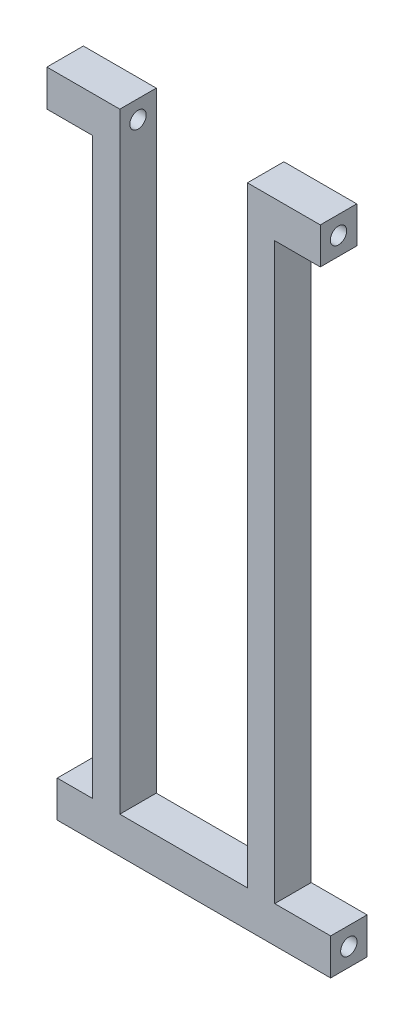
ISO-10303-21;
HEADER;
FILE_DESCRIPTION(('STEP AP214'),'2;1');
FILE_NAME('part.step','',(''),(''),'','','');
FILE_SCHEMA(('AUTOMOTIVE_DESIGN { 1 0 10303 214 1 1 1 1 }'));
ENDSEC;
DATA;
#1=APPLICATION_CONTEXT('core data for automotive mechanical design processes');
#2=APPLICATION_PROTOCOL_DEFINITION('international standard','automotive_design',2000,#1);
#3=PRODUCT_CONTEXT('',#1,'mechanical');
#4=PRODUCT('Part','Part','',(#3));
#5=PRODUCT_RELATED_PRODUCT_CATEGORY('part','',(#4));
#6=PRODUCT_DEFINITION_FORMATION('','',#4);
#7=PRODUCT_DEFINITION_CONTEXT('part definition',#1,'design');
#8=PRODUCT_DEFINITION('design','',#6,#7);
#9=PRODUCT_DEFINITION_SHAPE('','',#8);
#10=(LENGTH_UNIT() NAMED_UNIT(*) SI_UNIT(.MILLI.,.METRE.));
#11=(NAMED_UNIT(*) PLANE_ANGLE_UNIT() SI_UNIT($,.RADIAN.));
#12=(NAMED_UNIT(*) SI_UNIT($,.STERADIAN.) SOLID_ANGLE_UNIT());
#13=UNCERTAINTY_MEASURE_WITH_UNIT(LENGTH_MEASURE(1.E-05),#10,'distance_accuracy_value','');
#14=(GEOMETRIC_REPRESENTATION_CONTEXT(3) GLOBAL_UNCERTAINTY_ASSIGNED_CONTEXT((#13)) GLOBAL_UNIT_ASSIGNED_CONTEXT((#10,
#11,#12)) REPRESENTATION_CONTEXT('',''));
#15=CARTESIAN_POINT('',(0.,0.,0.));
#16=DIRECTION('',(0.,0.,1.));
#17=DIRECTION('',(1.,0.,0.));
#18=AXIS2_PLACEMENT_3D('',#15,#16,#17);
#19=CARTESIAN_POINT('',(-2.26904501258947,0.,8.));
#20=DIRECTION('',(1.,0.,0.));
#21=DIRECTION('',(0.,1.,0.));
#22=AXIS2_PLACEMENT_3D('',#19,#20,#21);
#23=PLANE('',#22);
#24=CARTESIAN_POINT('',(-2.2690450125895,138.,4.));
#25=DIRECTION('',(1.,0.,0.));
#26=DIRECTION('',(0.,0.,-1.));
#27=AXIS2_PLACEMENT_3D('',#24,#25,#26);
#28=CIRCLE('',#27,1.8);
#29=CARTESIAN_POINT('',(-2.2690450125895,138.,2.2));
#30=VERTEX_POINT('',#29);
#31=EDGE_CURVE('E206',#30,#30,#28,.T.);
#32=ORIENTED_EDGE('',*,*,#31,.T.);
#33=EDGE_LOOP('',(#32));
#34=FACE_BOUND('',#33,.T.);
#35=DIRECTION('',(0.,-1.,0.));
#36=VECTOR('',#35,1.);
#37=CARTESIAN_POINT('',(-2.26904501258947,0.,0.));
#38=LINE('',#37,#36);
#39=CARTESIAN_POINT('',(-2.26904501258951,142.,0.));
#40=VERTEX_POINT('',#39);
#41=CARTESIAN_POINT('',(-2.2690450125895,134.,0.));
#42=VERTEX_POINT('',#41);
#43=EDGE_CURVE('E202',#40,#42,#38,.T.);
#44=ORIENTED_EDGE('',*,*,#43,.T.);
#45=DIRECTION('',(0.,0.,-1.));
#46=VECTOR('',#45,1.);
#47=CARTESIAN_POINT('',(-2.2690450125895,134.,8.));
#48=LINE('',#47,#46);
#49=CARTESIAN_POINT('',(-2.2690450125895,134.,8.));
#50=VERTEX_POINT('',#49);
#51=EDGE_CURVE('E11',#50,#42,#48,.T.);
#52=ORIENTED_EDGE('',*,*,#51,.F.);
#53=DIRECTION('',(0.,-1.,0.));
#54=VECTOR('',#53,1.);
#55=CARTESIAN_POINT('',(-2.26904501258947,0.,8.));
#56=LINE('',#55,#54);
#57=CARTESIAN_POINT('',(-2.26904501258951,142.,8.));
#58=VERTEX_POINT('',#57);
#59=EDGE_CURVE('E194',#58,#50,#56,.T.);
#60=ORIENTED_EDGE('',*,*,#59,.F.);
#61=DIRECTION('',(0.,0.,-1.));
#62=VECTOR('',#61,1.);
#63=CARTESIAN_POINT('',(-2.26904501258951,142.,8.));
#64=LINE('',#63,#62);
#65=EDGE_CURVE('E49',#58,#40,#64,.T.);
#66=ORIENTED_EDGE('',*,*,#65,.T.);
#67=EDGE_LOOP('',(#44,#52,#60,#66));
#68=FACE_BOUND('',#67,.T.);
#69=ADVANCED_FACE('F33',(#34,#68),#23,.F.);
#70=CARTESIAN_POINT('',(0.,134.,8.));
#71=DIRECTION('',(0.,1.,0.));
#72=DIRECTION('',(0.,0.,1.));
#73=AXIS2_PLACEMENT_3D('',#70,#71,#72);
#74=PLANE('',#73);
#75=DIRECTION('',(1.,0.,0.));
#76=VECTOR('',#75,1.);
#77=CARTESIAN_POINT('',(0.,134.,0.));
#78=LINE('',#77,#76);
#79=CARTESIAN_POINT('',(7.7309549874105,134.,0.));
#80=VERTEX_POINT('',#79);
#81=EDGE_CURVE('E296',#42,#80,#78,.T.);
#82=ORIENTED_EDGE('',*,*,#81,.T.);
#83=DIRECTION('',(0.,0.,-1.));
#84=VECTOR('',#83,1.);
#85=CARTESIAN_POINT('',(7.7309549874105,134.,8.));
#86=LINE('',#85,#84);
#87=CARTESIAN_POINT('',(7.7309549874105,134.,8.));
#88=VERTEX_POINT('',#87);
#89=EDGE_CURVE('E41',#88,#80,#86,.T.);
#90=ORIENTED_EDGE('',*,*,#89,.F.);
#91=DIRECTION('',(1.,0.,0.));
#92=VECTOR('',#91,1.);
#93=CARTESIAN_POINT('',(0.,134.,8.));
#94=LINE('',#93,#92);
#95=EDGE_CURVE('E112',#50,#88,#94,.T.);
#96=ORIENTED_EDGE('',*,*,#95,.F.);
#97=ORIENTED_EDGE('',*,*,#51,.T.);
#98=EDGE_LOOP('',(#82,#90,#96,#97));
#99=FACE_BOUND('',#98,.T.);
#100=ADVANCED_FACE('F297',(#99),#74,.F.);
#101=CARTESIAN_POINT('',(7.7309549874105,0.,8.));
#102=DIRECTION('',(-1.,0.,0.));
#103=DIRECTION('',(0.,-1.,0.));
#104=AXIS2_PLACEMENT_3D('',#101,#102,#103);
#105=PLANE('',#104);
#106=DIRECTION('',(0.,1.,0.));
#107=VECTOR('',#106,1.);
#108=CARTESIAN_POINT('',(7.7309549874105,0.,0.));
#109=LINE('',#108,#107);
#110=CARTESIAN_POINT('',(7.7309549874105,8.,0.));
#111=VERTEX_POINT('',#110);
#112=EDGE_CURVE('E256',#111,#80,#109,.T.);
#113=ORIENTED_EDGE('',*,*,#112,.F.);
#114=DIRECTION('',(0.,0.,-1.));
#115=VECTOR('',#114,1.);
#116=CARTESIAN_POINT('',(7.7309549874105,8.,8.));
#117=LINE('',#116,#115);
#118=CARTESIAN_POINT('',(7.7309549874105,8.,8.));
#119=VERTEX_POINT('',#118);
#120=EDGE_CURVE('E291',#119,#111,#117,.T.);
#121=ORIENTED_EDGE('',*,*,#120,.F.);
#122=DIRECTION('',(0.,1.,0.));
#123=VECTOR('',#122,1.);
#124=CARTESIAN_POINT('',(7.7309549874105,0.,8.));
#125=LINE('',#124,#123);
#126=EDGE_CURVE('E186',#119,#88,#125,.T.);
#127=ORIENTED_EDGE('',*,*,#126,.T.);
#128=ORIENTED_EDGE('',*,*,#89,.T.);
#129=EDGE_LOOP('',(#113,#121,#127,#128));
#130=FACE_BOUND('',#129,.T.);
#131=ADVANCED_FACE('F294',(#130),#105,.T.);
#132=CARTESIAN_POINT('',(0.,8.,8.));
#133=DIRECTION('',(0.,1.,0.));
#134=DIRECTION('',(0.,0.,1.));
#135=AXIS2_PLACEMENT_3D('',#132,#133,#134);
#136=PLANE('',#135);
#137=DIRECTION('',(1.,0.,0.));
#138=VECTOR('',#137,1.);
#139=CARTESIAN_POINT('',(0.,8.,0.));
#140=LINE('',#139,#138);
#141=CARTESIAN_POINT('',(0.,8.,0.));
#142=VERTEX_POINT('',#141);
#143=EDGE_CURVE('E249',#142,#111,#140,.T.);
#144=ORIENTED_EDGE('',*,*,#143,.F.);
#145=DIRECTION('',(0.,0.,-1.));
#146=VECTOR('',#145,1.);
#147=CARTESIAN_POINT('',(0.,8.,8.));
#148=LINE('',#147,#146);
#149=CARTESIAN_POINT('',(0.,8.,8.));
#150=VERTEX_POINT('',#149);
#151=EDGE_CURVE('E289',#150,#142,#148,.T.);
#152=ORIENTED_EDGE('',*,*,#151,.F.);
#153=DIRECTION('',(1.,0.,0.));
#154=VECTOR('',#153,1.);
#155=CARTESIAN_POINT('',(0.,8.,8.));
#156=LINE('',#155,#154);
#157=EDGE_CURVE('E176',#150,#119,#156,.T.);
#158=ORIENTED_EDGE('',*,*,#157,.T.);
#159=ORIENTED_EDGE('',*,*,#120,.T.);
#160=EDGE_LOOP('',(#144,#152,#158,#159));
#161=FACE_BOUND('',#160,.T.);
#162=ADVANCED_FACE('F348',(#161),#136,.T.);
#163=CARTESIAN_POINT('',(0.,0.,8.));
#164=DIRECTION('',(-1.,0.,0.));
#165=DIRECTION('',(0.,0.,1.));
#166=AXIS2_PLACEMENT_3D('',#163,#164,#165);
#167=PLANE('',#166);
#168=CARTESIAN_POINT('',(0.,4.,4.));
#169=DIRECTION('',(-1.,0.,0.));
#170=DIRECTION('',(0.,0.,1.));
#171=AXIS2_PLACEMENT_3D('',#168,#169,#170);
#172=CIRCLE('',#171,1.79999999999999);
#173=CARTESIAN_POINT('',(0.,4.,5.79999999999999));
#174=VERTEX_POINT('',#173);
#175=EDGE_CURVE('E212',#174,#174,#172,.T.);
#176=ORIENTED_EDGE('',*,*,#175,.F.);
#177=EDGE_LOOP('',(#176));
#178=FACE_BOUND('',#177,.T.);
#179=DIRECTION('',(0.,1.,0.));
#180=VECTOR('',#179,1.);
#181=CARTESIAN_POINT('',(0.,0.,0.));
#182=LINE('',#181,#180);
#183=CARTESIAN_POINT('',(0.,0.,0.));
#184=VERTEX_POINT('',#183);
#185=EDGE_CURVE('E255',#184,#142,#182,.T.);
#186=ORIENTED_EDGE('',*,*,#185,.F.);
#187=DIRECTION('',(0.,0.,-1.));
#188=VECTOR('',#187,1.);
#189=CARTESIAN_POINT('',(0.,0.,8.));
#190=LINE('',#189,#188);
#191=CARTESIAN_POINT('',(0.,0.,8.));
#192=VERTEX_POINT('',#191);
#193=EDGE_CURVE('E287',#192,#184,#190,.T.);
#194=ORIENTED_EDGE('',*,*,#193,.F.);
#195=DIRECTION('',(0.,1.,0.));
#196=VECTOR('',#195,1.);
#197=CARTESIAN_POINT('',(0.,0.,8.));
#198=LINE('',#197,#196);
#199=EDGE_CURVE('E185',#192,#150,#198,.T.);
#200=ORIENTED_EDGE('',*,*,#199,.T.);
#201=ORIENTED_EDGE('',*,*,#151,.T.);
#202=EDGE_LOOP('',(#186,#194,#200,#201));
#203=FACE_BOUND('',#202,.T.);
#204=ADVANCED_FACE('F381',(#178,#203),#167,.T.);
#205=CARTESIAN_POINT('',(0.,0.,8.));
#206=DIRECTION('',(0.,1.,0.));
#207=DIRECTION('',(0.,0.,1.));
#208=AXIS2_PLACEMENT_3D('',#205,#206,#207);
#209=PLANE('',#208);
#210=DIRECTION('',(1.,0.,0.));
#211=VECTOR('',#210,1.);
#212=CARTESIAN_POINT('',(0.,0.,0.));
#213=LINE('',#212,#211);
#214=CARTESIAN_POINT('',(60.,0.,0.));
#215=VERTEX_POINT('',#214);
#216=EDGE_CURVE('E240',#184,#215,#213,.T.);
#217=ORIENTED_EDGE('',*,*,#216,.T.);
#218=DIRECTION('',(0.,0.,-1.));
#219=VECTOR('',#218,1.);
#220=CARTESIAN_POINT('',(60.,0.,8.));
#221=LINE('',#220,#219);
#222=CARTESIAN_POINT('',(60.,0.,8.));
#223=VERTEX_POINT('',#222);
#224=EDGE_CURVE('E236',#223,#215,#221,.T.);
#225=ORIENTED_EDGE('',*,*,#224,.F.);
#226=DIRECTION('',(1.,0.,0.));
#227=VECTOR('',#226,1.);
#228=CARTESIAN_POINT('',(0.,0.,8.));
#229=LINE('',#228,#227);
#230=EDGE_CURVE('E190',#192,#223,#229,.T.);
#231=ORIENTED_EDGE('',*,*,#230,.F.);
#232=ORIENTED_EDGE('',*,*,#193,.T.);
#233=EDGE_LOOP('',(#217,#225,#231,#232));
#234=FACE_BOUND('',#233,.T.);
#235=ADVANCED_FACE('F225',(#234),#209,.F.);
#236=CARTESIAN_POINT('',(60.,0.,8.));
#237=DIRECTION('',(-1.,0.,0.));
#238=DIRECTION('',(0.,0.,1.));
#239=AXIS2_PLACEMENT_3D('',#236,#237,#238);
#240=PLANE('',#239);
#241=CARTESIAN_POINT('',(60.,4.,4.));
#242=DIRECTION('',(1.,0.,0.));
#243=DIRECTION('',(0.,0.,-1.));
#244=AXIS2_PLACEMENT_3D('',#241,#242,#243);
#245=CIRCLE('',#244,1.79999999999999);
#246=CARTESIAN_POINT('',(60.,4.,2.20000000000001));
#247=VERTEX_POINT('',#246);
#248=EDGE_CURVE('E215',#247,#247,#245,.T.);
#249=ORIENTED_EDGE('',*,*,#248,.F.);
#250=EDGE_LOOP('',(#249));
#251=FACE_BOUND('',#250,.T.);
#252=DIRECTION('',(0.,1.,0.));
#253=VECTOR('',#252,1.);
#254=CARTESIAN_POINT('',(60.,0.,0.));
#255=LINE('',#254,#253);
#256=CARTESIAN_POINT('',(60.,8.,0.));
#257=VERTEX_POINT('',#256);
#258=EDGE_CURVE('E231',#215,#257,#255,.T.);
#259=ORIENTED_EDGE('',*,*,#258,.T.);
#260=DIRECTION('',(0.,0.,-1.));
#261=VECTOR('',#260,1.);
#262=CARTESIAN_POINT('',(60.,8.,8.));
#263=LINE('',#262,#261);
#264=CARTESIAN_POINT('',(60.,8.,8.));
#265=VERTEX_POINT('',#264);
#266=EDGE_CURVE('E234',#265,#257,#263,.T.);
#267=ORIENTED_EDGE('',*,*,#266,.F.);
#268=DIRECTION('',(0.,1.,0.));
#269=VECTOR('',#268,1.);
#270=CARTESIAN_POINT('',(60.,0.,8.));
#271=LINE('',#270,#269);
#272=EDGE_CURVE('E183',#223,#265,#271,.T.);
#273=ORIENTED_EDGE('',*,*,#272,.F.);
#274=ORIENTED_EDGE('',*,*,#224,.T.);
#275=EDGE_LOOP('',(#259,#267,#273,#274));
#276=FACE_BOUND('',#275,.T.);
#277=ADVANCED_FACE('F221',(#251,#276),#240,.F.);
#278=CARTESIAN_POINT('',(47.7309549874105,8.,0.));
#279=VERTEX_POINT('',#278);
#280=EDGE_CURVE('E239',#279,#257,#140,.T.);
#281=ORIENTED_EDGE('',*,*,#280,.F.);
#282=DIRECTION('',(0.,0.,-1.));
#283=VECTOR('',#282,1.);
#284=CARTESIAN_POINT('',(47.7309549874105,8.,8.));
#285=LINE('',#284,#283);
#286=CARTESIAN_POINT('',(47.7309549874105,8.,8.));
#287=VERTEX_POINT('',#286);
#288=EDGE_CURVE('E283',#287,#279,#285,.T.);
#289=ORIENTED_EDGE('',*,*,#288,.F.);
#290=EDGE_CURVE('E175',#287,#265,#156,.T.);
#291=ORIENTED_EDGE('',*,*,#290,.T.);
#292=ORIENTED_EDGE('',*,*,#266,.T.);
#293=EDGE_LOOP('',(#281,#289,#291,#292));
#294=FACE_BOUND('',#293,.T.);
#295=ADVANCED_FACE('F224',(#294),#136,.T.);
#296=CARTESIAN_POINT('',(47.7309549874105,0.,8.));
#297=DIRECTION('',(-1.,0.,0.));
#298=DIRECTION('',(0.,0.,1.));
#299=AXIS2_PLACEMENT_3D('',#296,#297,#298);
#300=PLANE('',#299);
#301=DIRECTION('',(0.,1.,0.));
#302=VECTOR('',#301,1.);
#303=CARTESIAN_POINT('',(47.7309549874105,0.,0.));
#304=LINE('',#303,#302);
#305=CARTESIAN_POINT('',(47.7309549874105,134.,0.));
#306=VERTEX_POINT('',#305);
#307=EDGE_CURVE('E246',#279,#306,#304,.T.);
#308=ORIENTED_EDGE('',*,*,#307,.T.);
#309=DIRECTION('',(0.,0.,-1.));
#310=VECTOR('',#309,1.);
#311=CARTESIAN_POINT('',(47.7309549874105,134.,8.));
#312=LINE('',#311,#310);
#313=CARTESIAN_POINT('',(47.7309549874105,134.,8.));
#314=VERTEX_POINT('',#313);
#315=EDGE_CURVE('E280',#314,#306,#312,.T.);
#316=ORIENTED_EDGE('',*,*,#315,.F.);
#317=DIRECTION('',(0.,1.,0.));
#318=VECTOR('',#317,1.);
#319=CARTESIAN_POINT('',(47.7309549874105,0.,8.));
#320=LINE('',#319,#318);
#321=EDGE_CURVE('E182',#287,#314,#320,.T.);
#322=ORIENTED_EDGE('',*,*,#321,.F.);
#323=ORIENTED_EDGE('',*,*,#288,.T.);
#324=EDGE_LOOP('',(#308,#316,#322,#323));
#325=FACE_BOUND('',#324,.T.);
#326=ADVANCED_FACE('F335',(#325),#300,.F.);
#327=CARTESIAN_POINT('',(0.,134.,8.));
#328=DIRECTION('',(0.,1.,0.));
#329=DIRECTION('',(0.,0.,1.));
#330=AXIS2_PLACEMENT_3D('',#327,#328,#329);
#331=PLANE('',#330);
#332=DIRECTION('',(1.,0.,0.));
#333=VECTOR('',#332,1.);
#334=CARTESIAN_POINT('',(0.,134.,0.));
#335=LINE('',#334,#333);
#336=CARTESIAN_POINT('',(57.7309549874105,134.,0.));
#337=VERTEX_POINT('',#336);
#338=EDGE_CURVE('E250',#306,#337,#335,.T.);
#339=ORIENTED_EDGE('',*,*,#338,.T.);
#340=DIRECTION('',(0.,0.,-1.));
#341=VECTOR('',#340,1.);
#342=CARTESIAN_POINT('',(57.7309549874105,134.,8.));
#343=LINE('',#342,#341);
#344=CARTESIAN_POINT('',(57.7309549874105,134.,8.));
#345=VERTEX_POINT('',#344);
#346=EDGE_CURVE('E278',#345,#337,#343,.T.);
#347=ORIENTED_EDGE('',*,*,#346,.F.);
#348=DIRECTION('',(1.,0.,0.));
#349=VECTOR('',#348,1.);
#350=CARTESIAN_POINT('',(0.,134.,8.));
#351=LINE('',#350,#349);
#352=EDGE_CURVE('E310',#314,#345,#351,.T.);
#353=ORIENTED_EDGE('',*,*,#352,.F.);
#354=ORIENTED_EDGE('',*,*,#315,.T.);
#355=EDGE_LOOP('',(#339,#347,#353,#354));
#356=FACE_BOUND('',#355,.T.);
#357=ADVANCED_FACE('F331',(#356),#331,.F.);
#358=CARTESIAN_POINT('',(57.7309549874104,0.,8.));
#359=DIRECTION('',(1.,0.,0.));
#360=DIRECTION('',(0.,1.,0.));
#361=AXIS2_PLACEMENT_3D('',#358,#359,#360);
#362=PLANE('',#361);
#363=CARTESIAN_POINT('',(57.7309549874105,138.,4.));
#364=DIRECTION('',(1.,0.,0.));
#365=DIRECTION('',(0.,0.,-1.));
#366=AXIS2_PLACEMENT_3D('',#363,#364,#365);
#367=CIRCLE('',#366,1.8);
#368=CARTESIAN_POINT('',(57.7309549874105,138.,2.2));
#369=VERTEX_POINT('',#368);
#370=EDGE_CURVE('E209',#369,#369,#367,.T.);
#371=ORIENTED_EDGE('',*,*,#370,.F.);
#372=EDGE_LOOP('',(#371));
#373=FACE_BOUND('',#372,.T.);
#374=DIRECTION('',(0.,-1.,0.));
#375=VECTOR('',#374,1.);
#376=CARTESIAN_POINT('',(57.7309549874104,0.,0.));
#377=LINE('',#376,#375);
#378=CARTESIAN_POINT('',(57.7309549874105,142.,0.));
#379=VERTEX_POINT('',#378);
#380=EDGE_CURVE('E265',#379,#337,#377,.T.);
#381=ORIENTED_EDGE('',*,*,#380,.F.);
#382=DIRECTION('',(0.,0.,-1.));
#383=VECTOR('',#382,1.);
#384=CARTESIAN_POINT('',(57.7309549874105,142.,8.));
#385=LINE('',#384,#383);
#386=CARTESIAN_POINT('',(57.7309549874105,142.,8.));
#387=VERTEX_POINT('',#386);
#388=EDGE_CURVE('E276',#387,#379,#385,.T.);
#389=ORIENTED_EDGE('',*,*,#388,.F.);
#390=DIRECTION('',(0.,-1.,0.));
#391=VECTOR('',#390,1.);
#392=CARTESIAN_POINT('',(57.7309549874104,0.,8.));
#393=LINE('',#392,#391);
#394=EDGE_CURVE('E307',#387,#345,#393,.T.);
#395=ORIENTED_EDGE('',*,*,#394,.T.);
#396=ORIENTED_EDGE('',*,*,#346,.T.);
#397=EDGE_LOOP('',(#381,#389,#395,#396));
#398=FACE_BOUND('',#397,.T.);
#399=ADVANCED_FACE('F326',(#373,#398),#362,.T.);
#400=CARTESIAN_POINT('',(0.,142.,8.));
#401=DIRECTION('',(0.,1.,0.));
#402=DIRECTION('',(0.,0.,1.));
#403=AXIS2_PLACEMENT_3D('',#400,#401,#402);
#404=PLANE('',#403);
#405=DIRECTION('',(1.,0.,0.));
#406=VECTOR('',#405,1.);
#407=CARTESIAN_POINT('',(0.,142.,0.));
#408=LINE('',#407,#406);
#409=CARTESIAN_POINT('',(41.7309549874105,142.,0.));
#410=VERTEX_POINT('',#409);
#411=EDGE_CURVE('E261',#410,#379,#408,.T.);
#412=ORIENTED_EDGE('',*,*,#411,.F.);
#413=DIRECTION('',(0.,0.,-1.));
#414=VECTOR('',#413,1.);
#415=CARTESIAN_POINT('',(41.7309549874105,142.,8.));
#416=LINE('',#415,#414);
#417=CARTESIAN_POINT('',(41.7309549874105,142.,8.));
#418=VERTEX_POINT('',#417);
#419=EDGE_CURVE('E274',#418,#410,#416,.T.);
#420=ORIENTED_EDGE('',*,*,#419,.F.);
#421=DIRECTION('',(1.,0.,0.));
#422=VECTOR('',#421,1.);
#423=CARTESIAN_POINT('',(0.,142.,8.));
#424=LINE('',#423,#422);
#425=EDGE_CURVE('E177',#418,#387,#424,.T.);
#426=ORIENTED_EDGE('',*,*,#425,.T.);
#427=ORIENTED_EDGE('',*,*,#388,.T.);
#428=EDGE_LOOP('',(#412,#420,#426,#427));
#429=FACE_BOUND('',#428,.T.);
#430=ADVANCED_FACE('F337',(#429),#404,.T.);
#431=CARTESIAN_POINT('',(41.7309549874105,0.,8.));
#432=DIRECTION('',(-1.,0.,0.));
#433=DIRECTION('',(0.,0.,1.));
#434=AXIS2_PLACEMENT_3D('',#431,#432,#433);
#435=PLANE('',#434);
#436=CARTESIAN_POINT('',(41.7309549874105,138.,4.));
#437=DIRECTION('',(-1.,0.,0.));
#438=DIRECTION('',(0.,0.,1.));
#439=AXIS2_PLACEMENT_3D('',#436,#437,#438);
#440=CIRCLE('',#439,1.8);
#441=CARTESIAN_POINT('',(41.7309549874105,138.,5.8));
#442=VERTEX_POINT('',#441);
#443=EDGE_CURVE('E203',#442,#442,#440,.T.);
#444=ORIENTED_EDGE('',*,*,#443,.F.);
#445=EDGE_LOOP('',(#444));
#446=FACE_BOUND('',#445,.T.);
#447=DIRECTION('',(0.,1.,0.));
#448=VECTOR('',#447,1.);
#449=CARTESIAN_POINT('',(41.7309549874105,0.,0.));
#450=LINE('',#449,#448);
#451=CARTESIAN_POINT('',(41.7309549874105,8.,0.));
#452=VERTEX_POINT('',#451);
#453=EDGE_CURVE('E258',#452,#410,#450,.T.);
#454=ORIENTED_EDGE('',*,*,#453,.F.);
#455=DIRECTION('',(0.,0.,-1.));
#456=VECTOR('',#455,1.);
#457=CARTESIAN_POINT('',(41.7309549874105,8.,8.));
#458=LINE('',#457,#456);
#459=CARTESIAN_POINT('',(41.7309549874105,8.,8.));
#460=VERTEX_POINT('',#459);
#461=EDGE_CURVE('E161',#460,#452,#458,.T.);
#462=ORIENTED_EDGE('',*,*,#461,.F.);
#463=DIRECTION('',(0.,1.,0.));
#464=VECTOR('',#463,1.);
#465=CARTESIAN_POINT('',(41.7309549874105,0.,8.));
#466=LINE('',#465,#464);
#467=EDGE_CURVE('E173',#460,#418,#466,.T.);
#468=ORIENTED_EDGE('',*,*,#467,.T.);
#469=ORIENTED_EDGE('',*,*,#419,.T.);
#470=EDGE_LOOP('',(#454,#462,#468,#469));
#471=FACE_BOUND('',#470,.T.);
#472=ADVANCED_FACE('F339',(#446,#471),#435,.T.);
#473=CARTESIAN_POINT('',(13.7309549874105,8.,0.));
#474=VERTEX_POINT('',#473);
#475=EDGE_CURVE('E158',#474,#452,#140,.T.);
#476=ORIENTED_EDGE('',*,*,#475,.F.);
#477=DIRECTION('',(0.,0.,-1.));
#478=VECTOR('',#477,1.);
#479=CARTESIAN_POINT('',(13.7309549874105,8.,8.));
#480=LINE('',#479,#478);
#481=CARTESIAN_POINT('',(13.7309549874105,8.,8.));
#482=VERTEX_POINT('',#481);
#483=EDGE_CURVE('E152',#482,#474,#480,.T.);
#484=ORIENTED_EDGE('',*,*,#483,.F.);
#485=EDGE_CURVE('E156',#482,#460,#156,.T.);
#486=ORIENTED_EDGE('',*,*,#485,.T.);
#487=ORIENTED_EDGE('',*,*,#461,.T.);
#488=EDGE_LOOP('',(#476,#484,#486,#487));
#489=FACE_BOUND('',#488,.T.);
#490=ADVANCED_FACE('F154',(#489),#136,.T.);
#491=CARTESIAN_POINT('',(13.7309549874105,0.,8.));
#492=DIRECTION('',(-1.,0.,0.));
#493=DIRECTION('',(0.,-1.,0.));
#494=AXIS2_PLACEMENT_3D('',#491,#492,#493);
#495=PLANE('',#494);
#496=CARTESIAN_POINT('',(13.7309549874105,138.,4.));
#497=DIRECTION('',(-1.,0.,0.));
#498=DIRECTION('',(0.,-1.,0.));
#499=AXIS2_PLACEMENT_3D('',#496,#497,#498);
#500=CIRCLE('',#499,1.8);
#501=CARTESIAN_POINT('',(13.7309549874105,136.2,4.));
#502=VERTEX_POINT('',#501);
#503=EDGE_CURVE('E199',#502,#502,#500,.T.);
#504=ORIENTED_EDGE('',*,*,#503,.T.);
#505=EDGE_LOOP('',(#504));
#506=FACE_BOUND('',#505,.T.);
#507=DIRECTION('',(0.,1.,0.));
#508=VECTOR('',#507,1.);
#509=CARTESIAN_POINT('',(13.7309549874105,0.,0.));
#510=LINE('',#509,#508);
#511=CARTESIAN_POINT('',(13.7309549874105,142.,0.));
#512=VERTEX_POINT('',#511);
#513=EDGE_CURVE('E257',#474,#512,#510,.T.);
#514=ORIENTED_EDGE('',*,*,#513,.T.);
#515=DIRECTION('',(0.,0.,-1.));
#516=VECTOR('',#515,1.);
#517=CARTESIAN_POINT('',(13.7309549874105,142.,8.));
#518=LINE('',#517,#516);
#519=CARTESIAN_POINT('',(13.7309549874105,142.,8.));
#520=VERTEX_POINT('',#519);
#521=EDGE_CURVE('E100',#520,#512,#518,.T.);
#522=ORIENTED_EDGE('',*,*,#521,.F.);
#523=DIRECTION('',(0.,1.,0.));
#524=VECTOR('',#523,1.);
#525=CARTESIAN_POINT('',(13.7309549874105,0.,8.));
#526=LINE('',#525,#524);
#527=EDGE_CURVE('E163',#482,#520,#526,.T.);
#528=ORIENTED_EDGE('',*,*,#527,.F.);
#529=ORIENTED_EDGE('',*,*,#483,.T.);
#530=EDGE_LOOP('',(#514,#522,#528,#529));
#531=FACE_BOUND('',#530,.T.);
#532=ADVANCED_FACE('F164',(#506,#531),#495,.F.);
#533=CARTESIAN_POINT('',(0.,142.,8.));
#534=DIRECTION('',(0.,1.,0.));
#535=DIRECTION('',(0.,0.,1.));
#536=AXIS2_PLACEMENT_3D('',#533,#534,#535);
#537=PLANE('',#536);
#538=DIRECTION('',(1.,0.,0.));
#539=VECTOR('',#538,1.);
#540=CARTESIAN_POINT('',(0.,142.,0.));
#541=LINE('',#540,#539);
#542=EDGE_CURVE('E198',#40,#512,#541,.T.);
#543=ORIENTED_EDGE('',*,*,#542,.F.);
#544=ORIENTED_EDGE('',*,*,#65,.F.);
#545=DIRECTION('',(1.,0.,0.));
#546=VECTOR('',#545,1.);
#547=CARTESIAN_POINT('',(0.,142.,8.));
#548=LINE('',#547,#546);
#549=EDGE_CURVE('E167',#58,#520,#548,.T.);
#550=ORIENTED_EDGE('',*,*,#549,.T.);
#551=ORIENTED_EDGE('',*,*,#521,.T.);
#552=EDGE_LOOP('',(#543,#544,#550,#551));
#553=FACE_BOUND('',#552,.T.);
#554=ADVANCED_FACE('F357',(#553),#537,.T.);
#555=CARTESIAN_POINT('',(0.,0.,8.));
#556=DIRECTION('',(0.,0.,1.));
#557=DIRECTION('',(1.,0.,0.));
#558=AXIS2_PLACEMENT_3D('',#555,#556,#557);
#559=PLANE('',#558);
#560=ORIENTED_EDGE('',*,*,#59,.T.);
#561=ORIENTED_EDGE('',*,*,#95,.T.);
#562=ORIENTED_EDGE('',*,*,#126,.F.);
#563=ORIENTED_EDGE('',*,*,#157,.F.);
#564=ORIENTED_EDGE('',*,*,#199,.F.);
#565=ORIENTED_EDGE('',*,*,#230,.T.);
#566=ORIENTED_EDGE('',*,*,#272,.T.);
#567=ORIENTED_EDGE('',*,*,#290,.F.);
#568=ORIENTED_EDGE('',*,*,#321,.T.);
#569=ORIENTED_EDGE('',*,*,#352,.T.);
#570=ORIENTED_EDGE('',*,*,#394,.F.);
#571=ORIENTED_EDGE('',*,*,#425,.F.);
#572=ORIENTED_EDGE('',*,*,#467,.F.);
#573=ORIENTED_EDGE('',*,*,#485,.F.);
#574=ORIENTED_EDGE('',*,*,#527,.T.);
#575=ORIENTED_EDGE('',*,*,#549,.F.);
#576=EDGE_LOOP('',(#560,#561,#562,#563,#564,#565,#566,#567,#568,#569,#570,#571,#572,#573,#574,#575));
#577=FACE_BOUND('',#576,.T.);
#578=ADVANCED_FACE('F170',(#577),#559,.T.);
#579=CARTESIAN_POINT('',(0.,0.,0.));
#580=DIRECTION('',(0.,0.,1.));
#581=DIRECTION('',(1.,0.,0.));
#582=AXIS2_PLACEMENT_3D('',#579,#580,#581);
#583=PLANE('',#582);
#584=ORIENTED_EDGE('',*,*,#43,.F.);
#585=ORIENTED_EDGE('',*,*,#542,.T.);
#586=ORIENTED_EDGE('',*,*,#513,.F.);
#587=ORIENTED_EDGE('',*,*,#475,.T.);
#588=ORIENTED_EDGE('',*,*,#453,.T.);
#589=ORIENTED_EDGE('',*,*,#411,.T.);
#590=ORIENTED_EDGE('',*,*,#380,.T.);
#591=ORIENTED_EDGE('',*,*,#338,.F.);
#592=ORIENTED_EDGE('',*,*,#307,.F.);
#593=ORIENTED_EDGE('',*,*,#280,.T.);
#594=ORIENTED_EDGE('',*,*,#258,.F.);
#595=ORIENTED_EDGE('',*,*,#216,.F.);
#596=ORIENTED_EDGE('',*,*,#185,.T.);
#597=ORIENTED_EDGE('',*,*,#143,.T.);
#598=ORIENTED_EDGE('',*,*,#112,.T.);
#599=ORIENTED_EDGE('',*,*,#81,.F.);
#600=EDGE_LOOP('',(#584,#585,#586,#587,#588,#589,#590,#591,#592,#593,#594,#595,#596,#597,#598,#599));
#601=FACE_BOUND('',#600,.T.);
#602=ADVANCED_FACE('F244',(#601),#583,.F.);
#603=CARTESIAN_POINT('',(57.7309549874105,138.,4.));
#604=DIRECTION('',(1.,0.,0.));
#605=DIRECTION('',(0.,0.,-1.));
#606=AXIS2_PLACEMENT_3D('',#603,#604,#605);
#607=CYLINDRICAL_SURFACE('',#606,1.8);
#608=ORIENTED_EDGE('',*,*,#31,.F.);
#609=EDGE_LOOP('',(#608));
#610=FACE_BOUND('',#609,.T.);
#611=ORIENTED_EDGE('',*,*,#503,.F.);
#612=EDGE_LOOP('',(#611));
#613=FACE_BOUND('',#612,.T.);
#614=ADVANCED_FACE('F369',(#610,#613),#607,.F.);
#615=ORIENTED_EDGE('',*,*,#443,.T.);
#616=EDGE_LOOP('',(#615));
#617=FACE_BOUND('',#616,.T.);
#618=ORIENTED_EDGE('',*,*,#370,.T.);
#619=EDGE_LOOP('',(#618));
#620=FACE_BOUND('',#619,.T.);
#621=ADVANCED_FACE('F371',(#617,#620),#607,.F.);
#622=CARTESIAN_POINT('',(60.,4.,4.));
#623=DIRECTION('',(1.,0.,0.));
#624=DIRECTION('',(0.,0.,-1.));
#625=AXIS2_PLACEMENT_3D('',#622,#623,#624);
#626=CYLINDRICAL_SURFACE('',#625,1.79999999999999);
#627=ORIENTED_EDGE('',*,*,#175,.T.);
#628=EDGE_LOOP('',(#627));
#629=FACE_BOUND('',#628,.T.);
#630=ORIENTED_EDGE('',*,*,#248,.T.);
#631=EDGE_LOOP('',(#630));
#632=FACE_BOUND('',#631,.T.);
#633=ADVANCED_FACE('F219',(#629,#632),#626,.F.);
#634=CLOSED_SHELL('',(#69,#100,#131,#162,#204,#235,#277,#295,#326,#357,#399,#430,#472,#490,#532,
#554,#578,#602,#614,#621,#633));
#635=MANIFOLD_SOLID_BREP('B2',#634);
#636=ADVANCED_BREP_SHAPE_REPRESENTATION('',(#18,#635),#14);
#637=SHAPE_DEFINITION_REPRESENTATION(#9,#636);
ENDSEC;
END-ISO-10303-21;
